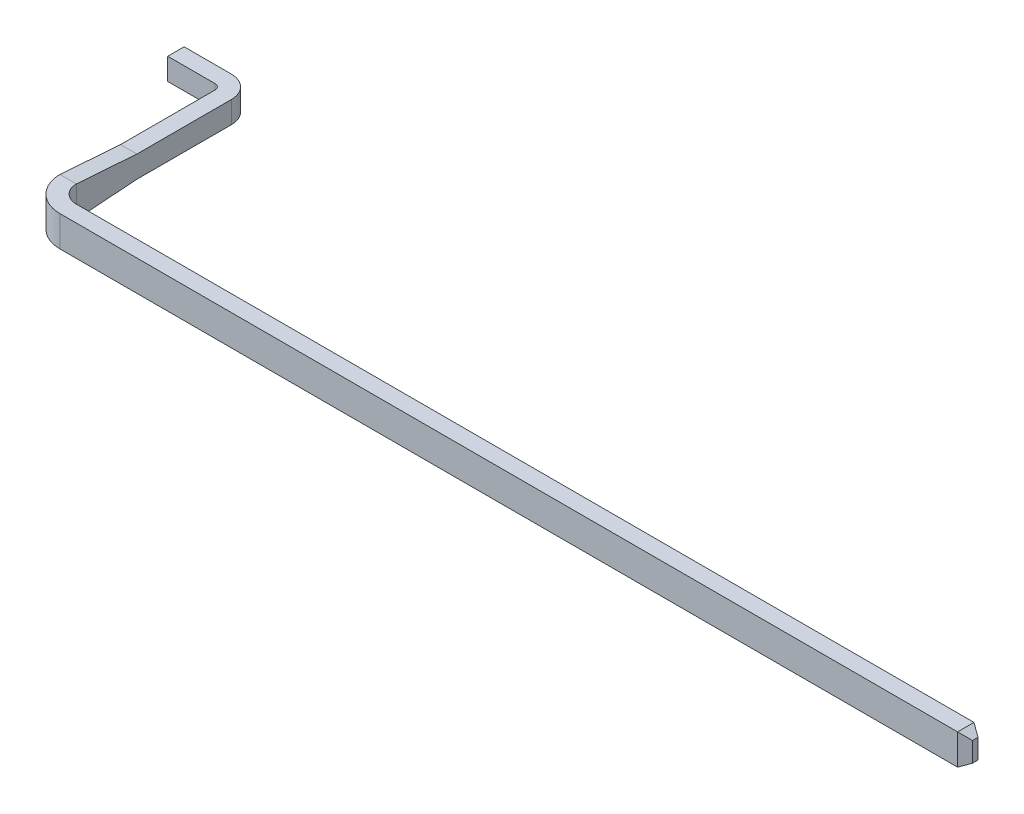
ISO-10303-21;
HEADER;
FILE_DESCRIPTION(('STEP AP214'),'2;1');
FILE_NAME('part.step','',(''),(''),'','','');
FILE_SCHEMA(('AUTOMOTIVE_DESIGN { 1 0 10303 214 1 1 1 1 }'));
ENDSEC;
DATA;
#1=APPLICATION_CONTEXT('core data for automotive mechanical design processes');
#2=APPLICATION_PROTOCOL_DEFINITION('international standard','automotive_design',2000,#1);
#3=PRODUCT_CONTEXT('',#1,'mechanical');
#4=PRODUCT('Part','Part','',(#3));
#5=PRODUCT_RELATED_PRODUCT_CATEGORY('part','',(#4));
#6=PRODUCT_DEFINITION_FORMATION('','',#4);
#7=PRODUCT_DEFINITION_CONTEXT('part definition',#1,'design');
#8=PRODUCT_DEFINITION('design','',#6,#7);
#9=PRODUCT_DEFINITION_SHAPE('','',#8);
#10=(LENGTH_UNIT() NAMED_UNIT(*) SI_UNIT(.MILLI.,.METRE.));
#11=(NAMED_UNIT(*) PLANE_ANGLE_UNIT() SI_UNIT($,.RADIAN.));
#12=(NAMED_UNIT(*) SI_UNIT($,.STERADIAN.) SOLID_ANGLE_UNIT());
#13=UNCERTAINTY_MEASURE_WITH_UNIT(LENGTH_MEASURE(1.E-05),#10,'distance_accuracy_value','');
#14=(GEOMETRIC_REPRESENTATION_CONTEXT(3) GLOBAL_UNCERTAINTY_ASSIGNED_CONTEXT((#13)) GLOBAL_UNIT_ASSIGNED_CONTEXT((#10,
#11,#12)) REPRESENTATION_CONTEXT('',''));
#15=CARTESIAN_POINT('',(0.,0.,0.));
#16=DIRECTION('',(0.,0.,1.));
#17=DIRECTION('',(1.,0.,0.));
#18=AXIS2_PLACEMENT_3D('',#15,#16,#17);
#19=CARTESIAN_POINT('',(-1.033705765484,0.14,0.94));
#20=DIRECTION('',(0.,0.,-1.));
#21=DIRECTION('',(-1.,0.,0.));
#22=AXIS2_PLACEMENT_3D('',#19,#20,#21);
#23=PLANE('',#22);
#24=DIRECTION('',(1.,0.,0.));
#25=VECTOR('',#24,1.);
#26=CARTESIAN_POINT('',(0.16,-0.1,0.94));
#27=LINE('',#26,#25);
#28=CARTESIAN_POINT('',(-0.633705765484,-0.1,0.94));
#29=VERTEX_POINT('',#28);
#30=CARTESIAN_POINT('',(-0.2,-0.1,0.94));
#31=VERTEX_POINT('',#30);
#32=EDGE_CURVE('E275',#29,#31,#27,.T.);
#33=ORIENTED_EDGE('',*,*,#32,.T.);
#34=DIRECTION('',(0.,1.,0.));
#35=VECTOR('',#34,1.);
#36=CARTESIAN_POINT('',(-0.2,-0.1,0.94));
#37=LINE('',#36,#35);
#38=CARTESIAN_POINT('',(-0.2,0.1,0.94));
#39=VERTEX_POINT('',#38);
#40=EDGE_CURVE('E95',#31,#39,#37,.T.);
#41=ORIENTED_EDGE('',*,*,#40,.T.);
#42=DIRECTION('',(1.,0.,0.));
#43=VECTOR('',#42,1.);
#44=CARTESIAN_POINT('',(0.16,0.1,0.94));
#45=LINE('',#44,#43);
#46=CARTESIAN_POINT('',(-0.633705765484,0.1,0.94));
#47=VERTEX_POINT('',#46);
#48=EDGE_CURVE('E299',#47,#39,#45,.T.);
#49=ORIENTED_EDGE('',*,*,#48,.F.);
#50=DIRECTION('',(0.,1.,0.));
#51=VECTOR('',#50,1.);
#52=CARTESIAN_POINT('',(-0.633705765484,0.,0.94));
#53=LINE('',#52,#51);
#54=EDGE_CURVE('E104',#29,#47,#53,.T.);
#55=ORIENTED_EDGE('',*,*,#54,.F.);
#56=EDGE_LOOP('',(#33,#41,#49,#55));
#57=FACE_BOUND('',#56,.T.);
#58=ADVANCED_FACE('F17',(#57),#23,.F.);
#59=CARTESIAN_POINT('',(-0.2,-0.1,0.99));
#60=DIRECTION('',(0.,1.,0.));
#61=DIRECTION('',(0.,0.,1.));
#62=AXIS2_PLACEMENT_3D('',#59,#60,#61);
#63=CYLINDRICAL_SURFACE('',#62,0.05);
#64=DIRECTION('',(0.,1.,0.));
#65=VECTOR('',#64,1.);
#66=CARTESIAN_POINT('',(-0.15,0.14,0.99));
#67=LINE('',#66,#65);
#68=CARTESIAN_POINT('',(-0.15,-0.1,0.99));
#69=VERTEX_POINT('',#68);
#70=CARTESIAN_POINT('',(-0.15,0.1,0.99));
#71=VERTEX_POINT('',#70);
#72=EDGE_CURVE('E323',#69,#71,#67,.T.);
#73=ORIENTED_EDGE('',*,*,#72,.T.);
#74=CARTESIAN_POINT('',(-0.2,0.1,0.99));
#75=DIRECTION('',(0.,1.,0.));
#76=DIRECTION('',(0.,0.,1.));
#77=AXIS2_PLACEMENT_3D('',#74,#75,#76);
#78=CIRCLE('',#77,0.05);
#79=EDGE_CURVE('E20',#39,#71,#78,.F.);
#80=ORIENTED_EDGE('',*,*,#79,.F.);
#81=ORIENTED_EDGE('',*,*,#40,.F.);
#82=CARTESIAN_POINT('',(-0.2,-0.1,0.99));
#83=DIRECTION('',(0.,1.,0.));
#84=DIRECTION('',(0.,0.,1.));
#85=AXIS2_PLACEMENT_3D('',#82,#83,#84);
#86=CIRCLE('',#85,0.05);
#87=EDGE_CURVE('E272',#31,#69,#86,.F.);
#88=ORIENTED_EDGE('',*,*,#87,.T.);
#89=EDGE_LOOP('',(#73,#80,#81,#88));
#90=FACE_BOUND('',#89,.T.);
#91=ADVANCED_FACE('F357',(#90),#63,.F.);
#92=CARTESIAN_POINT('',(-1.033705765484,0.14,0.79));
#93=DIRECTION('',(0.,0.,-1.));
#94=DIRECTION('',(-1.,0.,0.));
#95=AXIS2_PLACEMENT_3D('',#92,#93,#94);
#96=PLANE('',#95);
#97=DIRECTION('',(1.,0.,0.));
#98=VECTOR('',#97,1.);
#99=CARTESIAN_POINT('',(0.16,0.1,0.79));
#100=LINE('',#99,#98);
#101=CARTESIAN_POINT('',(-0.2,0.1,0.79));
#102=VERTEX_POINT('',#101);
#103=CARTESIAN_POINT('',(-0.633705765484,0.1,0.79));
#104=VERTEX_POINT('',#103);
#105=EDGE_CURVE('E305',#102,#104,#100,.F.);
#106=ORIENTED_EDGE('',*,*,#105,.F.);
#107=DIRECTION('',(0.,1.,0.));
#108=VECTOR('',#107,1.);
#109=CARTESIAN_POINT('',(-0.2,-0.1,0.79));
#110=LINE('',#109,#108);
#111=CARTESIAN_POINT('',(-0.2,-0.1,0.79));
#112=VERTEX_POINT('',#111);
#113=EDGE_CURVE('E308',#112,#102,#110,.T.);
#114=ORIENTED_EDGE('',*,*,#113,.F.);
#115=DIRECTION('',(1.,0.,0.));
#116=VECTOR('',#115,1.);
#117=CARTESIAN_POINT('',(0.16,-0.1,0.79));
#118=LINE('',#117,#116);
#119=CARTESIAN_POINT('',(-0.633705765484,-0.1,0.79));
#120=VERTEX_POINT('',#119);
#121=EDGE_CURVE('E114',#112,#120,#118,.F.);
#122=ORIENTED_EDGE('',*,*,#121,.T.);
#123=DIRECTION('',(0.,1.,0.));
#124=VECTOR('',#123,1.);
#125=CARTESIAN_POINT('',(-0.633705765484,0.,0.79));
#126=LINE('',#125,#124);
#127=EDGE_CURVE('E314',#104,#120,#126,.F.);
#128=ORIENTED_EDGE('',*,*,#127,.F.);
#129=EDGE_LOOP('',(#106,#114,#122,#128));
#130=FACE_BOUND('',#129,.T.);
#131=ADVANCED_FACE('F347',(#130),#96,.T.);
#132=CARTESIAN_POINT('',(-0.633705765484,0.,0.));
#133=DIRECTION('',(-1.,0.,0.));
#134=DIRECTION('',(0.,0.,1.));
#135=AXIS2_PLACEMENT_3D('',#132,#133,#134);
#136=PLANE('',#135);
#137=DIRECTION('',(0.,0.,1.));
#138=VECTOR('',#137,1.);
#139=CARTESIAN_POINT('',(-0.633705765484,-0.1,1.855));
#140=LINE('',#139,#138);
#141=EDGE_CURVE('E266',#120,#29,#140,.T.);
#142=ORIENTED_EDGE('',*,*,#141,.T.);
#143=ORIENTED_EDGE('',*,*,#54,.T.);
#144=DIRECTION('',(0.,0.,1.));
#145=VECTOR('',#144,1.);
#146=CARTESIAN_POINT('',(-0.633705765484,0.1,1.855));
#147=LINE('',#146,#145);
#148=EDGE_CURVE('E302',#104,#47,#147,.T.);
#149=ORIENTED_EDGE('',*,*,#148,.F.);
#150=ORIENTED_EDGE('',*,*,#127,.T.);
#151=EDGE_LOOP('',(#142,#143,#149,#150));
#152=FACE_BOUND('',#151,.T.);
#153=ADVANCED_FACE('F349',(#152),#136,.T.);
#154=CARTESIAN_POINT('',(-0.15,0.14,0.));
#155=DIRECTION('',(1.,0.,0.));
#156=DIRECTION('',(0.,0.,-1.));
#157=AXIS2_PLACEMENT_3D('',#154,#155,#156);
#158=PLANE('',#157);
#159=ORIENTED_EDGE('',*,*,#72,.F.);
#160=DIRECTION('',(0.,0.,1.));
#161=VECTOR('',#160,1.);
#162=CARTESIAN_POINT('',(-0.15,-0.1,1.855));
#163=LINE('',#162,#161);
#164=CARTESIAN_POINT('',(-0.15,-0.100000000000009,1.855));
#165=VERTEX_POINT('',#164);
#166=EDGE_CURVE('E270',#69,#165,#163,.T.);
#167=ORIENTED_EDGE('',*,*,#166,.T.);
#168=DIRECTION('',(0.,-0.0718856131691116,0.997412882721745));
#169=VECTOR('',#168,1.);
#170=CARTESIAN_POINT('',(-0.15,-0.14,2.41));
#171=LINE('',#170,#169);
#172=CARTESIAN_POINT('',(-0.15,-0.14,2.41));
#173=VERTEX_POINT('',#172);
#174=EDGE_CURVE('E243',#165,#173,#171,.T.);
#175=ORIENTED_EDGE('',*,*,#174,.T.);
#176=DIRECTION('',(0.,-1.,0.));
#177=VECTOR('',#176,1.);
#178=CARTESIAN_POINT('',(-0.15,0.14,2.41));
#179=LINE('',#178,#177);
#180=CARTESIAN_POINT('',(-0.15,0.14,2.41));
#181=VERTEX_POINT('',#180);
#182=EDGE_CURVE('E236',#181,#173,#179,.T.);
#183=ORIENTED_EDGE('',*,*,#182,.F.);
#184=DIRECTION('',(0.,0.0718856131691116,0.997412882721745));
#185=VECTOR('',#184,1.);
#186=CARTESIAN_POINT('',(-0.15,0.14,2.41));
#187=LINE('',#186,#185);
#188=CARTESIAN_POINT('',(-0.15,0.100000000000009,1.855));
#189=VERTEX_POINT('',#188);
#190=EDGE_CURVE('E257',#189,#181,#187,.T.);
#191=ORIENTED_EDGE('',*,*,#190,.F.);
#192=DIRECTION('',(0.,0.,1.));
#193=VECTOR('',#192,1.);
#194=CARTESIAN_POINT('',(-0.15,0.1,1.855));
#195=LINE('',#194,#193);
#196=EDGE_CURVE('E122',#71,#189,#195,.T.);
#197=ORIENTED_EDGE('',*,*,#196,.F.);
#198=EDGE_LOOP('',(#159,#167,#175,#183,#191,#197));
#199=FACE_BOUND('',#198,.T.);
#200=ADVANCED_FACE('F359',(#199),#158,.F.);
#201=CARTESIAN_POINT('',(8.46,0.14,2.67));
#202=DIRECTION('',(0.50000000000019,0.,0.866025403784329));
#203=DIRECTION('',(0.866025403784329,0.,-0.50000000000019));
#204=AXIS2_PLACEMENT_3D('',#201,#202,#203);
#205=PLANE('',#204);
#206=DIRECTION('',(-0.774596669240792,0.447213595499784,0.447213595501328));
#207=VECTOR('',#206,1.);
#208=CARTESIAN_POINT('',(8.4600000000001,0.0900000000001725,2.67));
#209=LINE('',#208,#207);
#210=CARTESIAN_POINT('',(8.46000000000007,0.090000000000115,2.67));
#211=VERTEX_POINT('',#210);
#212=CARTESIAN_POINT('',(8.373397459622,0.14,2.72));
#213=VERTEX_POINT('',#212);
#214=EDGE_CURVE('E254',#211,#213,#209,.T.);
#215=ORIENTED_EDGE('',*,*,#214,.T.);
#216=DIRECTION('',(0.,1.,0.));
#217=VECTOR('',#216,1.);
#218=CARTESIAN_POINT('',(8.373397459622,0.14,2.72));
#219=LINE('',#218,#217);
#220=CARTESIAN_POINT('',(8.37339745962197,-0.139999999999957,2.72));
#221=VERTEX_POINT('',#220);
#222=EDGE_CURVE('E235',#213,#221,#219,.F.);
#223=ORIENTED_EDGE('',*,*,#222,.T.);
#224=DIRECTION('',(-0.774596669240792,-0.447213595499785,0.447213595501328));
#225=VECTOR('',#224,1.);
#226=CARTESIAN_POINT('',(8.46,-0.09,2.67));
#227=LINE('',#226,#225);
#228=CARTESIAN_POINT('',(8.46,-0.09,2.67));
#229=VERTEX_POINT('',#228);
#230=EDGE_CURVE('E227',#229,#221,#227,.T.);
#231=ORIENTED_EDGE('',*,*,#230,.F.);
#232=DIRECTION('',(0.,1.,0.));
#233=VECTOR('',#232,1.);
#234=CARTESIAN_POINT('',(8.46,0.14,2.67));
#235=LINE('',#234,#233);
#236=EDGE_CURVE('E131',#211,#229,#235,.F.);
#237=ORIENTED_EDGE('',*,*,#236,.F.);
#238=EDGE_LOOP('',(#215,#223,#231,#237));
#239=FACE_BOUND('',#238,.T.);
#240=ADVANCED_FACE('F395',(#239),#205,.T.);
#241=CARTESIAN_POINT('',(-0.2,-0.1,0.99));
#242=DIRECTION('',(0.,1.,0.));
#243=DIRECTION('',(0.,0.,1.));
#244=AXIS2_PLACEMENT_3D('',#241,#242,#243);
#245=CYLINDRICAL_SURFACE('',#244,0.2);
#246=CARTESIAN_POINT('',(-0.2,0.1,0.99));
#247=DIRECTION('',(0.,1.,0.));
#248=DIRECTION('',(0.,0.,1.));
#249=AXIS2_PLACEMENT_3D('',#246,#247,#248);
#250=CIRCLE('',#249,0.2);
#251=CARTESIAN_POINT('',(0.,0.1,0.99));
#252=VERTEX_POINT('',#251);
#253=EDGE_CURVE('E277',#252,#102,#250,.T.);
#254=ORIENTED_EDGE('',*,*,#253,.F.);
#255=DIRECTION('',(0.,1.,0.));
#256=VECTOR('',#255,1.);
#257=CARTESIAN_POINT('',(0.,0.14,0.99));
#258=LINE('',#257,#256);
#259=CARTESIAN_POINT('',(0.,-0.1,0.99));
#260=VERTEX_POINT('',#259);
#261=EDGE_CURVE('E230',#260,#252,#258,.T.);
#262=ORIENTED_EDGE('',*,*,#261,.F.);
#263=CARTESIAN_POINT('',(-0.2,-0.1,0.99));
#264=DIRECTION('',(0.,1.,0.));
#265=DIRECTION('',(0.,0.,1.));
#266=AXIS2_PLACEMENT_3D('',#263,#264,#265);
#267=CIRCLE('',#266,0.2);
#268=EDGE_CURVE('E267',#260,#112,#267,.T.);
#269=ORIENTED_EDGE('',*,*,#268,.T.);
#270=ORIENTED_EDGE('',*,*,#113,.T.);
#271=EDGE_LOOP('',(#254,#262,#269,#270));
#272=FACE_BOUND('',#271,.T.);
#273=ADVANCED_FACE('F345',(#272),#245,.T.);
#274=CARTESIAN_POINT('',(0.16,0.1,1.855));
#275=DIRECTION('',(0.,1.,0.));
#276=DIRECTION('',(0.,0.,1.));
#277=AXIS2_PLACEMENT_3D('',#274,#275,#276);
#278=PLANE('',#277);
#279=DIRECTION('',(0.,0.,-1.));
#280=VECTOR('',#279,1.);
#281=CARTESIAN_POINT('',(0.,0.1,0.));
#282=LINE('',#281,#280);
#283=CARTESIAN_POINT('',(0.,0.100000000000005,1.85500000000001));
#284=VERTEX_POINT('',#283);
#285=EDGE_CURVE('E224',#252,#284,#282,.F.);
#286=ORIENTED_EDGE('',*,*,#285,.F.);
#287=ORIENTED_EDGE('',*,*,#253,.T.);
#288=ORIENTED_EDGE('',*,*,#105,.T.);
#289=ORIENTED_EDGE('',*,*,#148,.T.);
#290=ORIENTED_EDGE('',*,*,#48,.T.);
#291=ORIENTED_EDGE('',*,*,#79,.T.);
#292=ORIENTED_EDGE('',*,*,#196,.T.);
#293=DIRECTION('',(1.,0.,0.));
#294=VECTOR('',#293,1.);
#295=CARTESIAN_POINT('',(0.16,0.100000000000013,1.855));
#296=LINE('',#295,#294);
#297=EDGE_CURVE('E139',#284,#189,#296,.F.);
#298=ORIENTED_EDGE('',*,*,#297,.F.);
#299=EDGE_LOOP('',(#286,#287,#288,#289,#290,#291,#292,#298));
#300=FACE_BOUND('',#299,.T.);
#301=ADVANCED_FACE('F343',(#300),#278,.T.);
#302=CARTESIAN_POINT('',(0.16,-0.1,1.855));
#303=DIRECTION('',(0.,1.,0.));
#304=DIRECTION('',(0.,0.,1.));
#305=AXIS2_PLACEMENT_3D('',#302,#303,#304);
#306=PLANE('',#305);
#307=ORIENTED_EDGE('',*,*,#121,.F.);
#308=ORIENTED_EDGE('',*,*,#268,.F.);
#309=DIRECTION('',(0.,0.,-1.));
#310=VECTOR('',#309,1.);
#311=CARTESIAN_POINT('',(0.,-0.1,0.));
#312=LINE('',#311,#310);
#313=CARTESIAN_POINT('',(0.,-0.100000000000003,1.85499999999998));
#314=VERTEX_POINT('',#313);
#315=EDGE_CURVE('E208',#314,#260,#312,.T.);
#316=ORIENTED_EDGE('',*,*,#315,.F.);
#317=DIRECTION('',(1.,0.,0.));
#318=VECTOR('',#317,1.);
#319=CARTESIAN_POINT('',(0.16,-0.100000000000013,1.855));
#320=LINE('',#319,#318);
#321=EDGE_CURVE('E147',#314,#165,#320,.F.);
#322=ORIENTED_EDGE('',*,*,#321,.T.);
#323=ORIENTED_EDGE('',*,*,#166,.F.);
#324=ORIENTED_EDGE('',*,*,#87,.F.);
#325=ORIENTED_EDGE('',*,*,#32,.F.);
#326=ORIENTED_EDGE('',*,*,#141,.F.);
#327=EDGE_LOOP('',(#307,#308,#316,#322,#323,#324,#325,#326));
#328=FACE_BOUND('',#327,.T.);
#329=ADVANCED_FACE('F353',(#328),#306,.F.);
#330=CARTESIAN_POINT('',(0.16,0.14,2.41));
#331=DIRECTION('',(0.,0.997412882721745,-0.0718856131691116));
#332=DIRECTION('',(0.,0.0718856131691116,0.997412882721745));
#333=AXIS2_PLACEMENT_3D('',#330,#331,#332);
#334=PLANE('',#333);
#335=DIRECTION('',(1.,0.,0.));
#336=VECTOR('',#335,1.);
#337=CARTESIAN_POINT('',(0.16,0.14,2.41));
#338=LINE('',#337,#336);
#339=CARTESIAN_POINT('',(0.,0.14,2.41));
#340=VERTEX_POINT('',#339);
#341=EDGE_CURVE('E187',#340,#181,#338,.F.);
#342=ORIENTED_EDGE('',*,*,#341,.F.);
#343=DIRECTION('',(0.,0.0718856131691346,0.997412882721743));
#344=VECTOR('',#343,1.);
#345=CARTESIAN_POINT('',(0.,0.1,1.855));
#346=LINE('',#345,#344);
#347=EDGE_CURVE('E219',#284,#340,#346,.T.);
#348=ORIENTED_EDGE('',*,*,#347,.F.);
#349=ORIENTED_EDGE('',*,*,#297,.T.);
#350=ORIENTED_EDGE('',*,*,#190,.T.);
#351=EDGE_LOOP('',(#342,#348,#349,#350));
#352=FACE_BOUND('',#351,.T.);
#353=ADVANCED_FACE('F362',(#352),#334,.T.);
#354=CARTESIAN_POINT('',(8.46,0.14,2.57));
#355=DIRECTION('',(1.,0.,0.));
#356=DIRECTION('',(0.,0.,-1.));
#357=AXIS2_PLACEMENT_3D('',#354,#355,#356);
#358=PLANE('',#357);
#359=ORIENTED_EDGE('',*,*,#236,.T.);
#360=DIRECTION('',(0.,0.,1.));
#361=VECTOR('',#360,1.);
#362=CARTESIAN_POINT('',(8.46,-0.09,2.57));
#363=LINE('',#362,#361);
#364=CARTESIAN_POINT('',(8.46000000000007,-0.09,2.61999999999983));
#365=VERTEX_POINT('',#364);
#366=EDGE_CURVE('E159',#365,#229,#363,.T.);
#367=ORIENTED_EDGE('',*,*,#366,.F.);
#368=DIRECTION('',(0.,1.,0.));
#369=VECTOR('',#368,1.);
#370=CARTESIAN_POINT('',(8.4600000000001,0.14,2.61999999999983));
#371=LINE('',#370,#369);
#372=CARTESIAN_POINT('',(8.4600000000001,0.0900000000000575,2.61999999999983));
#373=VERTEX_POINT('',#372);
#374=EDGE_CURVE('E156',#365,#373,#371,.T.);
#375=ORIENTED_EDGE('',*,*,#374,.T.);
#376=DIRECTION('',(0.,0.,1.));
#377=VECTOR('',#376,1.);
#378=CARTESIAN_POINT('',(8.4600000000001,0.0900000000001725,2.57));
#379=LINE('',#378,#377);
#380=EDGE_CURVE('E172',#373,#211,#379,.T.);
#381=ORIENTED_EDGE('',*,*,#380,.T.);
#382=EDGE_LOOP('',(#359,#367,#375,#381));
#383=FACE_BOUND('',#382,.T.);
#384=ADVANCED_FACE('F396',(#383),#358,.T.);
#385=CARTESIAN_POINT('',(8.373397459622,0.14,2.57));
#386=DIRECTION('',(-0.50000000000019,-0.866025403784329,0.));
#387=DIRECTION('',(0.866025403784329,-0.50000000000019,0.));
#388=AXIS2_PLACEMENT_3D('',#385,#386,#387);
#389=PLANE('',#388);
#390=ORIENTED_EDGE('',*,*,#380,.F.);
#391=DIRECTION('',(-0.774596669240793,0.447213595501327,-0.447213595499785));
#392=VECTOR('',#391,1.);
#393=CARTESIAN_POINT('',(8.4600000000001,0.09,2.61999999999983));
#394=LINE('',#393,#392);
#395=CARTESIAN_POINT('',(8.373397459622,0.14,2.57));
#396=VERTEX_POINT('',#395);
#397=EDGE_CURVE('E166',#373,#396,#394,.T.);
#398=ORIENTED_EDGE('',*,*,#397,.T.);
#399=DIRECTION('',(0.,0.,1.));
#400=VECTOR('',#399,1.);
#401=CARTESIAN_POINT('',(8.373397459622,0.14,2.57));
#402=LINE('',#401,#400);
#403=EDGE_CURVE('E170',#213,#396,#402,.F.);
#404=ORIENTED_EDGE('',*,*,#403,.F.);
#405=ORIENTED_EDGE('',*,*,#214,.F.);
#406=EDGE_LOOP('',(#390,#398,#404,#405));
#407=FACE_BOUND('',#406,.T.);
#408=ADVANCED_FACE('F168',(#407),#389,.F.);
#409=CARTESIAN_POINT('',(0.16,-0.14,2.41));
#410=DIRECTION('',(0.,0.997412882721745,0.0718856131691116));
#411=DIRECTION('',(0.,-0.0718856131691116,0.997412882721745));
#412=AXIS2_PLACEMENT_3D('',#409,#410,#411);
#413=PLANE('',#412);
#414=DIRECTION('',(1.,0.,0.));
#415=VECTOR('',#414,1.);
#416=CARTESIAN_POINT('',(0.,-0.14,2.41));
#417=LINE('',#416,#415);
#418=CARTESIAN_POINT('',(0.,-0.14,2.41));
#419=VERTEX_POINT('',#418);
#420=EDGE_CURVE('E338',#419,#173,#417,.F.);
#421=ORIENTED_EDGE('',*,*,#420,.T.);
#422=ORIENTED_EDGE('',*,*,#174,.F.);
#423=ORIENTED_EDGE('',*,*,#321,.F.);
#424=DIRECTION('',(0.,0.0718856131691346,-0.997412882721743));
#425=VECTOR('',#424,1.);
#426=CARTESIAN_POINT('',(0.,-0.14,2.41));
#427=LINE('',#426,#425);
#428=EDGE_CURVE('E216',#419,#314,#427,.T.);
#429=ORIENTED_EDGE('',*,*,#428,.F.);
#430=EDGE_LOOP('',(#421,#422,#423,#429));
#431=FACE_BOUND('',#430,.T.);
#432=ADVANCED_FACE('F367',(#431),#413,.F.);
#433=CARTESIAN_POINT('',(0.16,0.14,2.41));
#434=DIRECTION('',(0.,-1.,0.));
#435=DIRECTION('',(0.,0.,-1.));
#436=AXIS2_PLACEMENT_3D('',#433,#434,#435);
#437=CYLINDRICAL_SURFACE('',#436,0.31);
#438=CARTESIAN_POINT('',(0.16,0.14,2.41));
#439=DIRECTION('',(0.,-1.,0.));
#440=DIRECTION('',(0.,0.,-1.));
#441=AXIS2_PLACEMENT_3D('',#438,#439,#440);
#442=CIRCLE('',#441,0.31);
#443=CARTESIAN_POINT('',(0.16,0.14,2.72));
#444=VERTEX_POINT('',#443);
#445=EDGE_CURVE('E206',#181,#444,#442,.F.);
#446=ORIENTED_EDGE('',*,*,#445,.F.);
#447=ORIENTED_EDGE('',*,*,#182,.T.);
#448=CARTESIAN_POINT('',(0.16,-0.14,2.41));
#449=DIRECTION('',(0.,-1.,0.));
#450=DIRECTION('',(0.,0.,-1.));
#451=AXIS2_PLACEMENT_3D('',#448,#449,#450);
#452=CIRCLE('',#451,0.31);
#453=CARTESIAN_POINT('',(0.16,-0.14,2.72));
#454=VERTEX_POINT('',#453);
#455=EDGE_CURVE('E335',#173,#454,#452,.F.);
#456=ORIENTED_EDGE('',*,*,#455,.T.);
#457=DIRECTION('',(0.,1.,0.));
#458=VECTOR('',#457,1.);
#459=CARTESIAN_POINT('',(0.16,0.14,2.72));
#460=LINE('',#459,#458);
#461=EDGE_CURVE('E233',#454,#444,#460,.T.);
#462=ORIENTED_EDGE('',*,*,#461,.T.);
#463=EDGE_LOOP('',(#446,#447,#456,#462));
#464=FACE_BOUND('',#463,.T.);
#465=ADVANCED_FACE('F371',(#464),#437,.T.);
#466=CARTESIAN_POINT('',(0.16,0.14,2.72));
#467=DIRECTION('',(0.,0.,-1.));
#468=DIRECTION('',(-1.,0.,0.));
#469=AXIS2_PLACEMENT_3D('',#466,#467,#468);
#470=PLANE('',#469);
#471=ORIENTED_EDGE('',*,*,#222,.F.);
#472=DIRECTION('',(1.,0.,0.));
#473=VECTOR('',#472,1.);
#474=CARTESIAN_POINT('',(0.16,0.14,2.72));
#475=LINE('',#474,#473);
#476=EDGE_CURVE('E186',#444,#213,#475,.T.);
#477=ORIENTED_EDGE('',*,*,#476,.F.);
#478=ORIENTED_EDGE('',*,*,#461,.F.);
#479=DIRECTION('',(1.,0.,0.));
#480=VECTOR('',#479,1.);
#481=CARTESIAN_POINT('',(0.,-0.14,2.72));
#482=LINE('',#481,#480);
#483=EDGE_CURVE('E337',#454,#221,#482,.T.);
#484=ORIENTED_EDGE('',*,*,#483,.T.);
#485=EDGE_LOOP('',(#471,#477,#478,#484));
#486=FACE_BOUND('',#485,.T.);
#487=ADVANCED_FACE('F397',(#486),#470,.F.);
#488=CARTESIAN_POINT('',(8.46,-0.09,2.57));
#489=DIRECTION('',(0.50000000000019,-0.866025403784329,0.));
#490=DIRECTION('',(0.866025403784329,0.50000000000019,0.));
#491=AXIS2_PLACEMENT_3D('',#488,#489,#490);
#492=PLANE('',#491);
#493=ORIENTED_EDGE('',*,*,#230,.T.);
#494=DIRECTION('',(0.,0.,1.));
#495=VECTOR('',#494,1.);
#496=CARTESIAN_POINT('',(8.373397459622,-0.14,0.));
#497=LINE('',#496,#495);
#498=CARTESIAN_POINT('',(8.373397459622,-0.14,2.57));
#499=VERTEX_POINT('',#498);
#500=EDGE_CURVE('E334',#221,#499,#497,.F.);
#501=ORIENTED_EDGE('',*,*,#500,.T.);
#502=DIRECTION('',(0.774596669240793,0.447213595501327,0.447213595499785));
#503=VECTOR('',#502,1.);
#504=CARTESIAN_POINT('',(8.373397459622,-0.14,2.57));
#505=LINE('',#504,#503);
#506=EDGE_CURVE('E175',#499,#365,#505,.T.);
#507=ORIENTED_EDGE('',*,*,#506,.T.);
#508=ORIENTED_EDGE('',*,*,#366,.T.);
#509=EDGE_LOOP('',(#493,#501,#507,#508));
#510=FACE_BOUND('',#509,.T.);
#511=ADVANCED_FACE('F394',(#510),#492,.T.);
#512=CARTESIAN_POINT('',(0.,0.14,0.));
#513=DIRECTION('',(1.,0.,0.));
#514=DIRECTION('',(0.,0.,-1.));
#515=AXIS2_PLACEMENT_3D('',#512,#513,#514);
#516=PLANE('',#515);
#517=ORIENTED_EDGE('',*,*,#428,.T.);
#518=ORIENTED_EDGE('',*,*,#315,.T.);
#519=ORIENTED_EDGE('',*,*,#261,.T.);
#520=ORIENTED_EDGE('',*,*,#285,.T.);
#521=ORIENTED_EDGE('',*,*,#347,.T.);
#522=DIRECTION('',(0.,-1.,0.));
#523=VECTOR('',#522,1.);
#524=CARTESIAN_POINT('',(0.,0.14,2.41));
#525=LINE('',#524,#523);
#526=EDGE_CURVE('E198',#340,#419,#525,.T.);
#527=ORIENTED_EDGE('',*,*,#526,.T.);
#528=EDGE_LOOP('',(#517,#518,#519,#520,#521,#527));
#529=FACE_BOUND('',#528,.T.);
#530=ADVANCED_FACE('F365',(#529),#516,.T.);
#531=CARTESIAN_POINT('',(0.16,0.14,2.57));
#532=DIRECTION('',(0.,1.,0.));
#533=DIRECTION('',(0.,0.,1.));
#534=AXIS2_PLACEMENT_3D('',#531,#532,#533);
#535=PLANE('',#534);
#536=ORIENTED_EDGE('',*,*,#341,.T.);
#537=ORIENTED_EDGE('',*,*,#445,.T.);
#538=ORIENTED_EDGE('',*,*,#476,.T.);
#539=ORIENTED_EDGE('',*,*,#403,.T.);
#540=DIRECTION('',(-1.,0.,0.));
#541=VECTOR('',#540,1.);
#542=CARTESIAN_POINT('',(0.16,0.14,2.57));
#543=LINE('',#542,#541);
#544=CARTESIAN_POINT('',(0.16,0.14,2.57));
#545=VERTEX_POINT('',#544);
#546=EDGE_CURVE('E182',#545,#396,#543,.F.);
#547=ORIENTED_EDGE('',*,*,#546,.F.);
#548=CARTESIAN_POINT('',(0.16,0.14,2.41));
#549=DIRECTION('',(0.,-1.,0.));
#550=DIRECTION('',(0.,0.,-1.));
#551=AXIS2_PLACEMENT_3D('',#548,#549,#550);
#552=CIRCLE('',#551,0.16);
#553=EDGE_CURVE('E215',#545,#340,#552,.T.);
#554=ORIENTED_EDGE('',*,*,#553,.T.);
#555=EDGE_LOOP('',(#536,#537,#538,#539,#547,#554));
#556=FACE_BOUND('',#555,.T.);
#557=ADVANCED_FACE('F179',(#556),#535,.T.);
#558=CARTESIAN_POINT('',(8.373397459622,0.14,2.57));
#559=DIRECTION('',(-0.50000000000019,0.,0.866025403784329));
#560=DIRECTION('',(0.866025403784329,0.,0.50000000000019));
#561=AXIS2_PLACEMENT_3D('',#558,#559,#560);
#562=PLANE('',#561);
#563=DIRECTION('',(0.,1.,0.));
#564=VECTOR('',#563,1.);
#565=CARTESIAN_POINT('',(8.373397459622,0.14,2.57));
#566=LINE('',#565,#564);
#567=EDGE_CURVE('E191',#396,#499,#566,.F.);
#568=ORIENTED_EDGE('',*,*,#567,.F.);
#569=ORIENTED_EDGE('',*,*,#397,.F.);
#570=ORIENTED_EDGE('',*,*,#374,.F.);
#571=ORIENTED_EDGE('',*,*,#506,.F.);
#572=EDGE_LOOP('',(#568,#569,#570,#571));
#573=FACE_BOUND('',#572,.T.);
#574=ADVANCED_FACE('F192',(#573),#562,.F.);
#575=CARTESIAN_POINT('',(0.,-0.14,0.));
#576=DIRECTION('',(0.,1.,0.));
#577=DIRECTION('',(0.,0.,1.));
#578=AXIS2_PLACEMENT_3D('',#575,#576,#577);
#579=PLANE('',#578);
#580=ORIENTED_EDGE('',*,*,#500,.F.);
#581=ORIENTED_EDGE('',*,*,#483,.F.);
#582=ORIENTED_EDGE('',*,*,#455,.F.);
#583=ORIENTED_EDGE('',*,*,#420,.F.);
#584=CARTESIAN_POINT('',(0.16,-0.14,2.41));
#585=DIRECTION('',(0.,-1.,0.));
#586=DIRECTION('',(0.,0.,-1.));
#587=AXIS2_PLACEMENT_3D('',#584,#585,#586);
#588=CIRCLE('',#587,0.16);
#589=CARTESIAN_POINT('',(0.16,-0.14,2.57));
#590=VERTEX_POINT('',#589);
#591=EDGE_CURVE('E35',#419,#590,#588,.F.);
#592=ORIENTED_EDGE('',*,*,#591,.T.);
#593=DIRECTION('',(-1.,0.,0.));
#594=VECTOR('',#593,1.);
#595=CARTESIAN_POINT('',(0.16,-0.14,2.57));
#596=LINE('',#595,#594);
#597=EDGE_CURVE('E26',#499,#590,#596,.T.);
#598=ORIENTED_EDGE('',*,*,#597,.F.);
#599=EDGE_LOOP('',(#580,#581,#582,#583,#592,#598));
#600=FACE_BOUND('',#599,.T.);
#601=ADVANCED_FACE('F375',(#600),#579,.F.);
#602=CARTESIAN_POINT('',(0.16,0.14,2.41));
#603=DIRECTION('',(0.,-1.,0.));
#604=DIRECTION('',(0.,0.,-1.));
#605=AXIS2_PLACEMENT_3D('',#602,#603,#604);
#606=CYLINDRICAL_SURFACE('',#605,0.16);
#607=ORIENTED_EDGE('',*,*,#526,.F.);
#608=ORIENTED_EDGE('',*,*,#553,.F.);
#609=DIRECTION('',(0.,1.,0.));
#610=VECTOR('',#609,1.);
#611=CARTESIAN_POINT('',(0.16,0.14,2.57));
#612=LINE('',#611,#610);
#613=EDGE_CURVE('E11',#590,#545,#612,.T.);
#614=ORIENTED_EDGE('',*,*,#613,.F.);
#615=ORIENTED_EDGE('',*,*,#591,.F.);
#616=EDGE_LOOP('',(#607,#608,#614,#615));
#617=FACE_BOUND('',#616,.T.);
#618=ADVANCED_FACE('F399',(#617),#606,.F.);
#619=CARTESIAN_POINT('',(0.16,0.14,2.57));
#620=DIRECTION('',(0.,0.,-1.));
#621=DIRECTION('',(-1.,0.,0.));
#622=AXIS2_PLACEMENT_3D('',#619,#620,#621);
#623=PLANE('',#622);
#624=ORIENTED_EDGE('',*,*,#597,.T.);
#625=ORIENTED_EDGE('',*,*,#613,.T.);
#626=ORIENTED_EDGE('',*,*,#546,.T.);
#627=ORIENTED_EDGE('',*,*,#567,.T.);
#628=EDGE_LOOP('',(#624,#625,#626,#627));
#629=FACE_BOUND('',#628,.T.);
#630=ADVANCED_FACE('F196',(#629),#623,.T.);
#631=CLOSED_SHELL('',(#58,#91,#131,#153,#200,#240,#273,#301,#329,#353,#384,#408,#432,#465,#487,
#511,#530,#557,#574,#601,#618,#630));
#632=MANIFOLD_SOLID_BREP('B1',#631);
#633=ADVANCED_BREP_SHAPE_REPRESENTATION('',(#18,#632),#14);
#634=SHAPE_DEFINITION_REPRESENTATION(#9,#633);
ENDSEC;
END-ISO-10303-21;
